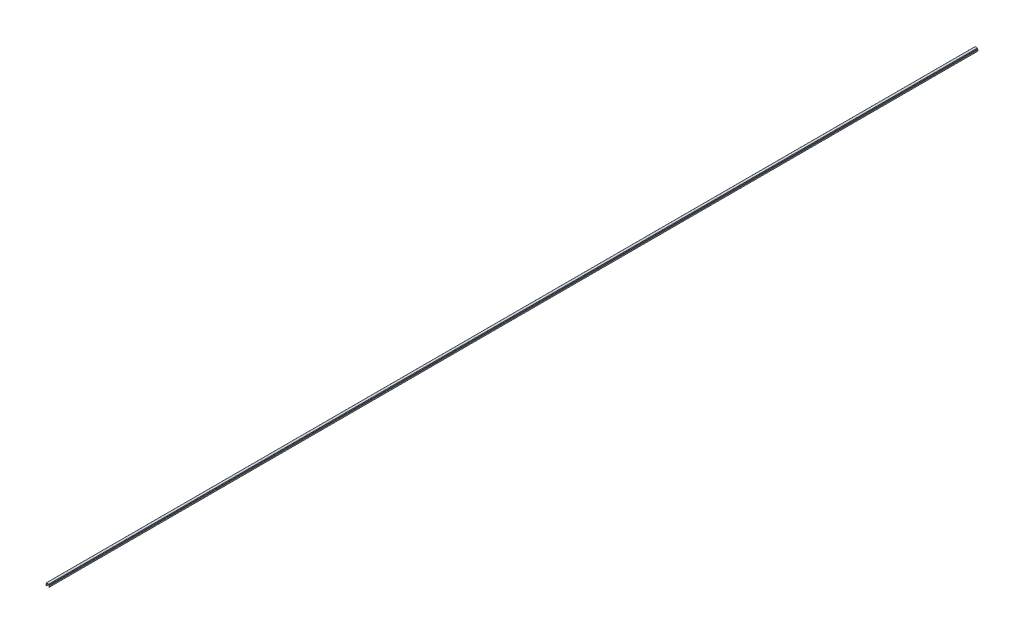
ISO-10303-21;
HEADER;
FILE_DESCRIPTION(('STEP AP214'),'2;1');
FILE_NAME('part.step','',(''),(''),'','','');
FILE_SCHEMA(('AUTOMOTIVE_DESIGN { 1 0 10303 214 1 1 1 1 }'));
ENDSEC;
DATA;
#1=APPLICATION_CONTEXT('core data for automotive mechanical design processes');
#2=APPLICATION_PROTOCOL_DEFINITION('international standard','automotive_design',2000,#1);
#3=PRODUCT_CONTEXT('',#1,'mechanical');
#4=PRODUCT('Part','Part','',(#3));
#5=PRODUCT_RELATED_PRODUCT_CATEGORY('part','',(#4));
#6=PRODUCT_DEFINITION_FORMATION('','',#4);
#7=PRODUCT_DEFINITION_CONTEXT('part definition',#1,'design');
#8=PRODUCT_DEFINITION('design','',#6,#7);
#9=PRODUCT_DEFINITION_SHAPE('','',#8);
#10=(LENGTH_UNIT() NAMED_UNIT(*) SI_UNIT(.MILLI.,.METRE.));
#11=(NAMED_UNIT(*) PLANE_ANGLE_UNIT() SI_UNIT($,.RADIAN.));
#12=(NAMED_UNIT(*) SI_UNIT($,.STERADIAN.) SOLID_ANGLE_UNIT());
#13=UNCERTAINTY_MEASURE_WITH_UNIT(LENGTH_MEASURE(1.E-05),#10,'distance_accuracy_value','');
#14=(GEOMETRIC_REPRESENTATION_CONTEXT(3) GLOBAL_UNCERTAINTY_ASSIGNED_CONTEXT((#13)) GLOBAL_UNIT_ASSIGNED_CONTEXT((#10,
#11,#12)) REPRESENTATION_CONTEXT('',''));
#15=CARTESIAN_POINT('',(0.,0.,0.));
#16=DIRECTION('',(0.,0.,1.));
#17=DIRECTION('',(1.,0.,0.));
#18=AXIS2_PLACEMENT_3D('',#15,#16,#17);
#19=CARTESIAN_POINT('',(-3.25000000000003,3.35000000000003,1000.));
#20=DIRECTION('',(0.,0.,-1.));
#21=DIRECTION('',(-1.,0.,0.));
#22=AXIS2_PLACEMENT_3D('',#19,#20,#21);
#23=CYLINDRICAL_SURFACE('',#22,0.349999999999972);
#24=DIRECTION('',(0.,0.,-1.));
#25=VECTOR('',#24,1.);
#26=CARTESIAN_POINT('',(-3.25,3.7,1000.));
#27=LINE('',#26,#25);
#28=CARTESIAN_POINT('',(-3.25,3.7,1000.));
#29=VERTEX_POINT('',#28);
#30=CARTESIAN_POINT('',(-3.25,3.7,-1000.));
#31=VERTEX_POINT('',#30);
#32=EDGE_CURVE('E211',#29,#31,#27,.T.);
#33=ORIENTED_EDGE('',*,*,#32,.T.);
#34=CARTESIAN_POINT('',(-3.25000000000003,3.35000000000003,-1000.));
#35=DIRECTION('',(0.,0.,1.));
#36=DIRECTION('',(1.,0.,0.));
#37=AXIS2_PLACEMENT_3D('',#34,#35,#36);
#38=CIRCLE('',#37,0.349999999999972);
#39=CARTESIAN_POINT('',(-3.6,3.35,-1000.));
#40=VERTEX_POINT('',#39);
#41=EDGE_CURVE('E205',#31,#40,#38,.T.);
#42=ORIENTED_EDGE('',*,*,#41,.T.);
#43=DIRECTION('',(0.,0.,-1.));
#44=VECTOR('',#43,1.);
#45=CARTESIAN_POINT('',(-3.6,3.35,1000.));
#46=LINE('',#45,#44);
#47=CARTESIAN_POINT('',(-3.6,3.35,1000.));
#48=VERTEX_POINT('',#47);
#49=EDGE_CURVE('E11',#48,#40,#46,.T.);
#50=ORIENTED_EDGE('',*,*,#49,.F.);
#51=CARTESIAN_POINT('',(-3.25000000000003,3.35000000000003,1000.));
#52=DIRECTION('',(0.,0.,1.));
#53=DIRECTION('',(1.,0.,0.));
#54=AXIS2_PLACEMENT_3D('',#51,#52,#53);
#55=CIRCLE('',#54,0.349999999999972);
#56=EDGE_CURVE('E277',#29,#48,#55,.T.);
#57=ORIENTED_EDGE('',*,*,#56,.F.);
#58=EDGE_LOOP('',(#33,#42,#50,#57));
#59=FACE_BOUND('',#58,.T.);
#60=ADVANCED_FACE('F33',(#59),#23,.T.);
#61=CARTESIAN_POINT('',(-3.6,3.35,1000.));
#62=DIRECTION('',(0.984336643247304,0.176299100283099,0.));
#63=DIRECTION('',(-0.176299100283099,0.984336643247304,0.));
#64=AXIS2_PLACEMENT_3D('',#61,#62,#63);
#65=PLANE('',#64);
#66=ORIENTED_EDGE('',*,*,#49,.T.);
#67=DIRECTION('',(0.176299100283099,-0.984336643247304,0.));
#68=VECTOR('',#67,1.);
#69=CARTESIAN_POINT('',(-3.6,3.35,-1000.));
#70=LINE('',#69,#68);
#71=CARTESIAN_POINT('',(-3.,0.,-1000.));
#72=VERTEX_POINT('',#71);
#73=EDGE_CURVE('E195',#40,#72,#70,.T.);
#74=ORIENTED_EDGE('',*,*,#73,.T.);
#75=DIRECTION('',(0.,0.,-1.));
#76=VECTOR('',#75,1.);
#77=CARTESIAN_POINT('',(-3.,0.,1000.));
#78=LINE('',#77,#76);
#79=CARTESIAN_POINT('',(-3.,0.,1000.));
#80=VERTEX_POINT('',#79);
#81=EDGE_CURVE('E40',#80,#72,#78,.T.);
#82=ORIENTED_EDGE('',*,*,#81,.F.);
#83=DIRECTION('',(0.176299100283099,-0.984336643247304,0.));
#84=VECTOR('',#83,1.);
#85=CARTESIAN_POINT('',(-3.6,3.35,1000.));
#86=LINE('',#85,#84);
#87=EDGE_CURVE('E196',#48,#80,#86,.T.);
#88=ORIENTED_EDGE('',*,*,#87,.F.);
#89=EDGE_LOOP('',(#66,#74,#82,#88));
#90=FACE_BOUND('',#89,.T.);
#91=ADVANCED_FACE('F193',(#90),#65,.F.);
#92=CARTESIAN_POINT('',(-3.,0.,1000.));
#93=DIRECTION('',(0.,1.,0.));
#94=DIRECTION('',(0.,0.,1.));
#95=AXIS2_PLACEMENT_3D('',#92,#93,#94);
#96=PLANE('',#95);
#97=ORIENTED_EDGE('',*,*,#81,.T.);
#98=DIRECTION('',(1.,0.,0.));
#99=VECTOR('',#98,1.);
#100=CARTESIAN_POINT('',(-3.,0.,-1000.));
#101=LINE('',#100,#99);
#102=CARTESIAN_POINT('',(-2.2,0.,-1000.));
#103=VERTEX_POINT('',#102);
#104=EDGE_CURVE('E209',#72,#103,#101,.T.);
#105=ORIENTED_EDGE('',*,*,#104,.T.);
#106=DIRECTION('',(0.,0.,-1.));
#107=VECTOR('',#106,1.);
#108=CARTESIAN_POINT('',(-2.2,0.,1000.));
#109=LINE('',#108,#107);
#110=CARTESIAN_POINT('',(-2.2,0.,1000.));
#111=VERTEX_POINT('',#110);
#112=EDGE_CURVE('E363',#111,#103,#109,.T.);
#113=ORIENTED_EDGE('',*,*,#112,.F.);
#114=DIRECTION('',(1.,0.,0.));
#115=VECTOR('',#114,1.);
#116=CARTESIAN_POINT('',(-3.,0.,1000.));
#117=LINE('',#116,#115);
#118=EDGE_CURVE('E280',#80,#111,#117,.T.);
#119=ORIENTED_EDGE('',*,*,#118,.F.);
#120=EDGE_LOOP('',(#97,#105,#113,#119));
#121=FACE_BOUND('',#120,.T.);
#122=ADVANCED_FACE('F366',(#121),#96,.F.);
#123=CARTESIAN_POINT('',(-2.2,0.,1000.));
#124=DIRECTION('',(-0.984336643247306,-0.176299100283088,0.));
#125=DIRECTION('',(0.176299100283088,-0.984336643247306,0.));
#126=AXIS2_PLACEMENT_3D('',#123,#124,#125);
#127=PLANE('',#126);
#128=ORIENTED_EDGE('',*,*,#112,.T.);
#129=DIRECTION('',(-0.176299100283088,0.984336643247306,0.));
#130=VECTOR('',#129,1.);
#131=CARTESIAN_POINT('',(-2.2,0.,-1000.));
#132=LINE('',#131,#130);
#133=CARTESIAN_POINT('',(-2.7352170713255,2.9882953149009,-1000.));
#134=VERTEX_POINT('',#133);
#135=EDGE_CURVE('E215',#103,#134,#132,.T.);
#136=ORIENTED_EDGE('',*,*,#135,.T.);
#137=DIRECTION('',(0.,0.,-1.));
#138=VECTOR('',#137,1.);
#139=CARTESIAN_POINT('',(-2.7352170713255,2.9882953149009,1000.));
#140=LINE('',#139,#138);
#141=CARTESIAN_POINT('',(-2.7352170713255,2.9882953149009,1000.));
#142=VERTEX_POINT('',#141);
#143=EDGE_CURVE('E361',#142,#134,#140,.T.);
#144=ORIENTED_EDGE('',*,*,#143,.F.);
#145=DIRECTION('',(-0.176299100283088,0.984336643247306,0.));
#146=VECTOR('',#145,1.);
#147=CARTESIAN_POINT('',(-2.2,0.,1000.));
#148=LINE('',#147,#146);
#149=EDGE_CURVE('E282',#111,#142,#148,.T.);
#150=ORIENTED_EDGE('',*,*,#149,.F.);
#151=EDGE_LOOP('',(#128,#136,#144,#150));
#152=FACE_BOUND('',#151,.T.);
#153=ADVANCED_FACE('F374',(#152),#127,.F.);
#154=CARTESIAN_POINT('',(-2.390699246189,3.05000000000004,1000.));
#155=DIRECTION('',(0.,0.,-1.));
#156=DIRECTION('',(-1.,0.,0.));
#157=AXIS2_PLACEMENT_3D('',#154,#155,#156);
#158=CYLINDRICAL_SURFACE('',#157,0.349999999999955);
#159=ORIENTED_EDGE('',*,*,#143,.T.);
#160=CARTESIAN_POINT('',(-2.390699246189,3.05000000000004,-1000.));
#161=DIRECTION('',(0.,0.,-1.));
#162=DIRECTION('',(-1.,0.,0.));
#163=AXIS2_PLACEMENT_3D('',#160,#161,#162);
#164=CIRCLE('',#163,0.349999999999955);
#165=CARTESIAN_POINT('',(-2.390699246189,3.4,-1000.));
#166=VERTEX_POINT('',#165);
#167=EDGE_CURVE('E218',#134,#166,#164,.T.);
#168=ORIENTED_EDGE('',*,*,#167,.T.);
#169=DIRECTION('',(0.,0.,-1.));
#170=VECTOR('',#169,1.);
#171=CARTESIAN_POINT('',(-2.390699246189,3.4,1000.));
#172=LINE('',#171,#170);
#173=CARTESIAN_POINT('',(-2.390699246189,3.4,1000.));
#174=VERTEX_POINT('',#173);
#175=EDGE_CURVE('E359',#174,#166,#172,.T.);
#176=ORIENTED_EDGE('',*,*,#175,.F.);
#177=CARTESIAN_POINT('',(-2.390699246189,3.05000000000004,1000.));
#178=DIRECTION('',(0.,0.,-1.));
#179=DIRECTION('',(-1.,0.,0.));
#180=AXIS2_PLACEMENT_3D('',#177,#178,#179);
#181=CIRCLE('',#180,0.349999999999955);
#182=EDGE_CURVE('E284',#142,#174,#181,.T.);
#183=ORIENTED_EDGE('',*,*,#182,.F.);
#184=EDGE_LOOP('',(#159,#168,#176,#183));
#185=FACE_BOUND('',#184,.T.);
#186=ADVANCED_FACE('F377',(#185),#158,.F.);
#187=CARTESIAN_POINT('',(-2.390699246189,3.4,1000.));
#188=DIRECTION('',(0.,1.,0.));
#189=DIRECTION('',(0.,0.,1.));
#190=AXIS2_PLACEMENT_3D('',#187,#188,#189);
#191=PLANE('',#190);
#192=ORIENTED_EDGE('',*,*,#175,.T.);
#193=DIRECTION('',(1.,0.,0.));
#194=VECTOR('',#193,1.);
#195=CARTESIAN_POINT('',(-2.390699246189,3.4,-1000.));
#196=LINE('',#195,#194);
#197=CARTESIAN_POINT('',(-2.2,3.4,-1000.));
#198=VERTEX_POINT('',#197);
#199=EDGE_CURVE('E221',#166,#198,#196,.T.);
#200=ORIENTED_EDGE('',*,*,#199,.T.);
#201=DIRECTION('',(0.,0.,-1.));
#202=VECTOR('',#201,1.);
#203=CARTESIAN_POINT('',(-2.2,3.4,1000.));
#204=LINE('',#203,#202);
#205=CARTESIAN_POINT('',(-2.2,3.4,1000.));
#206=VERTEX_POINT('',#205);
#207=EDGE_CURVE('E357',#206,#198,#204,.T.);
#208=ORIENTED_EDGE('',*,*,#207,.F.);
#209=DIRECTION('',(1.,0.,0.));
#210=VECTOR('',#209,1.);
#211=CARTESIAN_POINT('',(-2.390699246189,3.4,1000.));
#212=LINE('',#211,#210);
#213=EDGE_CURVE('E286',#174,#206,#212,.T.);
#214=ORIENTED_EDGE('',*,*,#213,.F.);
#215=EDGE_LOOP('',(#192,#200,#208,#214));
#216=FACE_BOUND('',#215,.T.);
#217=ADVANCED_FACE('F382',(#216),#191,.F.);
#218=CARTESIAN_POINT('',(-2.2,3.4,1000.));
#219=DIRECTION('',(-0.996194698091743,0.08715574274769,0.));
#220=DIRECTION('',(-0.08715574274769,-0.996194698091743,0.));
#221=AXIS2_PLACEMENT_3D('',#218,#219,#220);
#222=PLANE('',#221);
#223=ORIENTED_EDGE('',*,*,#207,.T.);
#224=DIRECTION('',(0.08715574274769,0.996194698091743,0.));
#225=VECTOR('',#224,1.);
#226=CARTESIAN_POINT('',(-2.2,3.4,-1000.));
#227=LINE('',#226,#225);
#228=CARTESIAN_POINT('',(-2.0704726390793,4.8805045099617,-1000.));
#229=VERTEX_POINT('',#228);
#230=EDGE_CURVE('E224',#198,#229,#227,.T.);
#231=ORIENTED_EDGE('',*,*,#230,.T.);
#232=DIRECTION('',(0.,0.,-1.));
#233=VECTOR('',#232,1.);
#234=CARTESIAN_POINT('',(-2.0704726390793,4.8805045099617,1000.));
#235=LINE('',#234,#233);
#236=CARTESIAN_POINT('',(-2.0704726390793,4.8805045099617,1000.));
#237=VERTEX_POINT('',#236);
#238=EDGE_CURVE('E355',#237,#229,#235,.T.);
#239=ORIENTED_EDGE('',*,*,#238,.F.);
#240=DIRECTION('',(0.08715574274769,0.996194698091743,0.));
#241=VECTOR('',#240,1.);
#242=CARTESIAN_POINT('',(-2.2,3.4,1000.));
#243=LINE('',#242,#241);
#244=EDGE_CURVE('E288',#206,#237,#243,.T.);
#245=ORIENTED_EDGE('',*,*,#244,.F.);
#246=EDGE_LOOP('',(#223,#231,#239,#245));
#247=FACE_BOUND('',#246,.T.);
#248=ADVANCED_FACE('F388',(#247),#222,.F.);
#249=CARTESIAN_POINT('',(-1.72180449474716,4.84999999999996,1000.));
#250=DIRECTION('',(0.,0.,-1.));
#251=DIRECTION('',(-1.,0.,0.));
#252=AXIS2_PLACEMENT_3D('',#249,#250,#251);
#253=CYLINDRICAL_SURFACE('',#252,0.350000000000036);
#254=ORIENTED_EDGE('',*,*,#238,.T.);
#255=CARTESIAN_POINT('',(-1.72180449474716,4.84999999999996,-1000.));
#256=DIRECTION('',(0.,0.,-1.));
#257=DIRECTION('',(-1.,0.,0.));
#258=AXIS2_PLACEMENT_3D('',#255,#256,#257);
#259=CIRCLE('',#258,0.350000000000036);
#260=CARTESIAN_POINT('',(-1.7218044947472,5.2,-1000.));
#261=VERTEX_POINT('',#260);
#262=EDGE_CURVE('E227',#229,#261,#259,.T.);
#263=ORIENTED_EDGE('',*,*,#262,.T.);
#264=DIRECTION('',(0.,0.,-1.));
#265=VECTOR('',#264,1.);
#266=CARTESIAN_POINT('',(-1.7218044947472,5.2,1000.));
#267=LINE('',#266,#265);
#268=CARTESIAN_POINT('',(-1.7218044947472,5.2,1000.));
#269=VERTEX_POINT('',#268);
#270=EDGE_CURVE('E353',#269,#261,#267,.T.);
#271=ORIENTED_EDGE('',*,*,#270,.F.);
#272=CARTESIAN_POINT('',(-1.72180449474716,4.84999999999996,1000.));
#273=DIRECTION('',(0.,0.,-1.));
#274=DIRECTION('',(-1.,0.,0.));
#275=AXIS2_PLACEMENT_3D('',#272,#273,#274);
#276=CIRCLE('',#275,0.350000000000036);
#277=EDGE_CURVE('E290',#237,#269,#276,.T.);
#278=ORIENTED_EDGE('',*,*,#277,.F.);
#279=EDGE_LOOP('',(#254,#263,#271,#278));
#280=FACE_BOUND('',#279,.T.);
#281=ADVANCED_FACE('F392',(#280),#253,.F.);
#282=CARTESIAN_POINT('',(-1.7218044947472,5.2,1000.));
#283=DIRECTION('',(0.,1.,0.));
#284=DIRECTION('',(0.,0.,1.));
#285=AXIS2_PLACEMENT_3D('',#282,#283,#284);
#286=PLANE('',#285);
#287=ORIENTED_EDGE('',*,*,#270,.T.);
#288=DIRECTION('',(1.,0.,0.));
#289=VECTOR('',#288,1.);
#290=CARTESIAN_POINT('',(-1.7218044947472,5.2,-1000.));
#291=LINE('',#290,#289);
#292=CARTESIAN_POINT('',(1.7218044947472,5.2,-1000.));
#293=VERTEX_POINT('',#292);
#294=EDGE_CURVE('E230',#261,#293,#291,.T.);
#295=ORIENTED_EDGE('',*,*,#294,.T.);
#296=DIRECTION('',(0.,0.,-1.));
#297=VECTOR('',#296,1.);
#298=CARTESIAN_POINT('',(1.7218044947472,5.2,1000.));
#299=LINE('',#298,#297);
#300=CARTESIAN_POINT('',(1.7218044947472,5.2,1000.));
#301=VERTEX_POINT('',#300);
#302=EDGE_CURVE('E351',#301,#293,#299,.T.);
#303=ORIENTED_EDGE('',*,*,#302,.F.);
#304=DIRECTION('',(1.,0.,0.));
#305=VECTOR('',#304,1.);
#306=CARTESIAN_POINT('',(-1.7218044947472,5.2,1000.));
#307=LINE('',#306,#305);
#308=EDGE_CURVE('E292',#269,#301,#307,.T.);
#309=ORIENTED_EDGE('',*,*,#308,.F.);
#310=EDGE_LOOP('',(#287,#295,#303,#309));
#311=FACE_BOUND('',#310,.T.);
#312=ADVANCED_FACE('F397',(#311),#286,.F.);
#313=CARTESIAN_POINT('',(1.72180449474716,4.84999999999996,1000.));
#314=DIRECTION('',(0.,0.,-1.));
#315=DIRECTION('',(-1.,0.,0.));
#316=AXIS2_PLACEMENT_3D('',#313,#314,#315);
#317=CYLINDRICAL_SURFACE('',#316,0.350000000000036);
#318=ORIENTED_EDGE('',*,*,#302,.T.);
#319=CARTESIAN_POINT('',(1.72180449474716,4.84999999999996,-1000.));
#320=DIRECTION('',(0.,0.,-1.));
#321=DIRECTION('',(-1.,0.,0.));
#322=AXIS2_PLACEMENT_3D('',#319,#320,#321);
#323=CIRCLE('',#322,0.350000000000036);
#324=CARTESIAN_POINT('',(2.0704726390793,4.8805045099617,-1000.));
#325=VERTEX_POINT('',#324);
#326=EDGE_CURVE('E233',#293,#325,#323,.T.);
#327=ORIENTED_EDGE('',*,*,#326,.T.);
#328=DIRECTION('',(0.,0.,-1.));
#329=VECTOR('',#328,1.);
#330=CARTESIAN_POINT('',(2.0704726390793,4.8805045099617,1000.));
#331=LINE('',#330,#329);
#332=CARTESIAN_POINT('',(2.0704726390793,4.8805045099617,1000.));
#333=VERTEX_POINT('',#332);
#334=EDGE_CURVE('E349',#333,#325,#331,.T.);
#335=ORIENTED_EDGE('',*,*,#334,.F.);
#336=CARTESIAN_POINT('',(1.72180449474716,4.84999999999996,1000.));
#337=DIRECTION('',(0.,0.,-1.));
#338=DIRECTION('',(-1.,0.,0.));
#339=AXIS2_PLACEMENT_3D('',#336,#337,#338);
#340=CIRCLE('',#339,0.350000000000036);
#341=EDGE_CURVE('E294',#301,#333,#340,.T.);
#342=ORIENTED_EDGE('',*,*,#341,.F.);
#343=EDGE_LOOP('',(#318,#327,#335,#342));
#344=FACE_BOUND('',#343,.T.);
#345=ADVANCED_FACE('F403',(#344),#317,.F.);
#346=CARTESIAN_POINT('',(2.0704726390793,4.8805045099617,1000.));
#347=DIRECTION('',(0.996194698091743,0.08715574274769,0.));
#348=DIRECTION('',(-0.08715574274769,0.996194698091743,0.));
#349=AXIS2_PLACEMENT_3D('',#346,#347,#348);
#350=PLANE('',#349);
#351=ORIENTED_EDGE('',*,*,#334,.T.);
#352=DIRECTION('',(0.08715574274769,-0.996194698091743,0.));
#353=VECTOR('',#352,1.);
#354=CARTESIAN_POINT('',(2.0704726390793,4.8805045099617,-1000.));
#355=LINE('',#354,#353);
#356=CARTESIAN_POINT('',(2.2,3.4,-1000.));
#357=VERTEX_POINT('',#356);
#358=EDGE_CURVE('E236',#325,#357,#355,.T.);
#359=ORIENTED_EDGE('',*,*,#358,.T.);
#360=DIRECTION('',(0.,0.,-1.));
#361=VECTOR('',#360,1.);
#362=CARTESIAN_POINT('',(2.2,3.4,1000.));
#363=LINE('',#362,#361);
#364=CARTESIAN_POINT('',(2.2,3.4,1000.));
#365=VERTEX_POINT('',#364);
#366=EDGE_CURVE('E347',#365,#357,#363,.T.);
#367=ORIENTED_EDGE('',*,*,#366,.F.);
#368=DIRECTION('',(0.08715574274769,-0.996194698091743,0.));
#369=VECTOR('',#368,1.);
#370=CARTESIAN_POINT('',(2.0704726390793,4.8805045099617,1000.));
#371=LINE('',#370,#369);
#372=EDGE_CURVE('E296',#333,#365,#371,.T.);
#373=ORIENTED_EDGE('',*,*,#372,.F.);
#374=EDGE_LOOP('',(#351,#359,#367,#373));
#375=FACE_BOUND('',#374,.T.);
#376=ADVANCED_FACE('F407',(#375),#350,.F.);
#377=CARTESIAN_POINT('',(2.2,3.4,1000.));
#378=DIRECTION('',(0.,1.,0.));
#379=DIRECTION('',(0.,0.,1.));
#380=AXIS2_PLACEMENT_3D('',#377,#378,#379);
#381=PLANE('',#380);
#382=ORIENTED_EDGE('',*,*,#366,.T.);
#383=DIRECTION('',(1.,0.,0.));
#384=VECTOR('',#383,1.);
#385=CARTESIAN_POINT('',(2.2,3.4,-1000.));
#386=LINE('',#385,#384);
#387=CARTESIAN_POINT('',(2.390699246189,3.4,-1000.));
#388=VERTEX_POINT('',#387);
#389=EDGE_CURVE('E239',#357,#388,#386,.T.);
#390=ORIENTED_EDGE('',*,*,#389,.T.);
#391=DIRECTION('',(0.,0.,-1.));
#392=VECTOR('',#391,1.);
#393=CARTESIAN_POINT('',(2.390699246189,3.4,1000.));
#394=LINE('',#393,#392);
#395=CARTESIAN_POINT('',(2.390699246189,3.4,1000.));
#396=VERTEX_POINT('',#395);
#397=EDGE_CURVE('E345',#396,#388,#394,.T.);
#398=ORIENTED_EDGE('',*,*,#397,.F.);
#399=DIRECTION('',(1.,0.,0.));
#400=VECTOR('',#399,1.);
#401=CARTESIAN_POINT('',(2.2,3.4,1000.));
#402=LINE('',#401,#400);
#403=EDGE_CURVE('E298',#365,#396,#402,.T.);
#404=ORIENTED_EDGE('',*,*,#403,.F.);
#405=EDGE_LOOP('',(#382,#390,#398,#404));
#406=FACE_BOUND('',#405,.T.);
#407=ADVANCED_FACE('F412',(#406),#381,.F.);
#408=CARTESIAN_POINT('',(2.390699246189,3.05000000000004,1000.));
#409=DIRECTION('',(0.,0.,-1.));
#410=DIRECTION('',(-1.,0.,0.));
#411=AXIS2_PLACEMENT_3D('',#408,#409,#410);
#412=CYLINDRICAL_SURFACE('',#411,0.349999999999955);
#413=ORIENTED_EDGE('',*,*,#397,.T.);
#414=CARTESIAN_POINT('',(2.390699246189,3.05000000000004,-1000.));
#415=DIRECTION('',(0.,0.,-1.));
#416=DIRECTION('',(-1.,0.,0.));
#417=AXIS2_PLACEMENT_3D('',#414,#415,#416);
#418=CIRCLE('',#417,0.349999999999955);
#419=CARTESIAN_POINT('',(2.7352170713255,2.9882953149009,-1000.));
#420=VERTEX_POINT('',#419);
#421=EDGE_CURVE('E242',#388,#420,#418,.T.);
#422=ORIENTED_EDGE('',*,*,#421,.T.);
#423=DIRECTION('',(0.,0.,-1.));
#424=VECTOR('',#423,1.);
#425=CARTESIAN_POINT('',(2.7352170713255,2.9882953149009,1000.));
#426=LINE('',#425,#424);
#427=CARTESIAN_POINT('',(2.7352170713255,2.9882953149009,1000.));
#428=VERTEX_POINT('',#427);
#429=EDGE_CURVE('E343',#428,#420,#426,.T.);
#430=ORIENTED_EDGE('',*,*,#429,.F.);
#431=CARTESIAN_POINT('',(2.390699246189,3.05000000000004,1000.));
#432=DIRECTION('',(0.,0.,-1.));
#433=DIRECTION('',(-1.,0.,0.));
#434=AXIS2_PLACEMENT_3D('',#431,#432,#433);
#435=CIRCLE('',#434,0.349999999999955);
#436=EDGE_CURVE('E300',#396,#428,#435,.T.);
#437=ORIENTED_EDGE('',*,*,#436,.F.);
#438=EDGE_LOOP('',(#413,#422,#430,#437));
#439=FACE_BOUND('',#438,.T.);
#440=ADVANCED_FACE('F418',(#439),#412,.F.);
#441=CARTESIAN_POINT('',(2.7352170713255,2.9882953149009,1000.));
#442=DIRECTION('',(0.984336643247306,-0.176299100283088,0.));
#443=DIRECTION('',(0.176299100283088,0.984336643247306,0.));
#444=AXIS2_PLACEMENT_3D('',#441,#442,#443);
#445=PLANE('',#444);
#446=ORIENTED_EDGE('',*,*,#429,.T.);
#447=DIRECTION('',(-0.176299100283088,-0.984336643247306,0.));
#448=VECTOR('',#447,1.);
#449=CARTESIAN_POINT('',(2.7352170713255,2.9882953149009,-1000.));
#450=LINE('',#449,#448);
#451=CARTESIAN_POINT('',(2.2,0.,-1000.));
#452=VERTEX_POINT('',#451);
#453=EDGE_CURVE('E245',#420,#452,#450,.T.);
#454=ORIENTED_EDGE('',*,*,#453,.T.);
#455=DIRECTION('',(0.,0.,-1.));
#456=VECTOR('',#455,1.);
#457=CARTESIAN_POINT('',(2.2,0.,1000.));
#458=LINE('',#457,#456);
#459=CARTESIAN_POINT('',(2.2,0.,1000.));
#460=VERTEX_POINT('',#459);
#461=EDGE_CURVE('E341',#460,#452,#458,.T.);
#462=ORIENTED_EDGE('',*,*,#461,.F.);
#463=DIRECTION('',(-0.176299100283088,-0.984336643247306,0.));
#464=VECTOR('',#463,1.);
#465=CARTESIAN_POINT('',(2.7352170713255,2.9882953149009,1000.));
#466=LINE('',#465,#464);
#467=EDGE_CURVE('E302',#428,#460,#466,.T.);
#468=ORIENTED_EDGE('',*,*,#467,.F.);
#469=EDGE_LOOP('',(#446,#454,#462,#468));
#470=FACE_BOUND('',#469,.T.);
#471=ADVANCED_FACE('F422',(#470),#445,.F.);
#472=CARTESIAN_POINT('',(2.2,0.,1000.));
#473=DIRECTION('',(0.,1.,0.));
#474=DIRECTION('',(0.,0.,1.));
#475=AXIS2_PLACEMENT_3D('',#472,#473,#474);
#476=PLANE('',#475);
#477=ORIENTED_EDGE('',*,*,#461,.T.);
#478=DIRECTION('',(1.,0.,0.));
#479=VECTOR('',#478,1.);
#480=CARTESIAN_POINT('',(2.2,0.,-1000.));
#481=LINE('',#480,#479);
#482=CARTESIAN_POINT('',(3.,0.,-1000.));
#483=VERTEX_POINT('',#482);
#484=EDGE_CURVE('E248',#452,#483,#481,.T.);
#485=ORIENTED_EDGE('',*,*,#484,.T.);
#486=DIRECTION('',(0.,0.,-1.));
#487=VECTOR('',#486,1.);
#488=CARTESIAN_POINT('',(3.,0.,1000.));
#489=LINE('',#488,#487);
#490=CARTESIAN_POINT('',(3.,0.,1000.));
#491=VERTEX_POINT('',#490);
#492=EDGE_CURVE('E339',#491,#483,#489,.T.);
#493=ORIENTED_EDGE('',*,*,#492,.F.);
#494=DIRECTION('',(1.,0.,0.));
#495=VECTOR('',#494,1.);
#496=CARTESIAN_POINT('',(2.2,0.,1000.));
#497=LINE('',#496,#495);
#498=EDGE_CURVE('E304',#460,#491,#497,.T.);
#499=ORIENTED_EDGE('',*,*,#498,.F.);
#500=EDGE_LOOP('',(#477,#485,#493,#499));
#501=FACE_BOUND('',#500,.T.);
#502=ADVANCED_FACE('F427',(#501),#476,.F.);
#503=CARTESIAN_POINT('',(3.,0.,1000.));
#504=DIRECTION('',(-0.984336643247304,0.176299100283099,0.));
#505=DIRECTION('',(-0.176299100283099,-0.984336643247304,0.));
#506=AXIS2_PLACEMENT_3D('',#503,#504,#505);
#507=PLANE('',#506);
#508=ORIENTED_EDGE('',*,*,#492,.T.);
#509=DIRECTION('',(0.176299100283099,0.984336643247304,0.));
#510=VECTOR('',#509,1.);
#511=CARTESIAN_POINT('',(3.,0.,-1000.));
#512=LINE('',#511,#510);
#513=CARTESIAN_POINT('',(3.6,3.35,-1000.));
#514=VERTEX_POINT('',#513);
#515=EDGE_CURVE('E251',#483,#514,#512,.T.);
#516=ORIENTED_EDGE('',*,*,#515,.T.);
#517=DIRECTION('',(0.,0.,-1.));
#518=VECTOR('',#517,1.);
#519=CARTESIAN_POINT('',(3.6,3.35,1000.));
#520=LINE('',#519,#518);
#521=CARTESIAN_POINT('',(3.6,3.35,1000.));
#522=VERTEX_POINT('',#521);
#523=EDGE_CURVE('E337',#522,#514,#520,.T.);
#524=ORIENTED_EDGE('',*,*,#523,.F.);
#525=DIRECTION('',(0.176299100283099,0.984336643247304,0.));
#526=VECTOR('',#525,1.);
#527=CARTESIAN_POINT('',(3.,0.,1000.));
#528=LINE('',#527,#526);
#529=EDGE_CURVE('E306',#491,#522,#528,.T.);
#530=ORIENTED_EDGE('',*,*,#529,.F.);
#531=EDGE_LOOP('',(#508,#516,#524,#530));
#532=FACE_BOUND('',#531,.T.);
#533=ADVANCED_FACE('F433',(#532),#507,.F.);
#534=CARTESIAN_POINT('',(3.25000000000003,3.35000000000003,1000.));
#535=DIRECTION('',(0.,0.,-1.));
#536=DIRECTION('',(-1.,0.,0.));
#537=AXIS2_PLACEMENT_3D('',#534,#535,#536);
#538=CYLINDRICAL_SURFACE('',#537,0.349999999999972);
#539=ORIENTED_EDGE('',*,*,#523,.T.);
#540=CARTESIAN_POINT('',(3.25000000000003,3.35000000000003,-1000.));
#541=DIRECTION('',(0.,0.,1.));
#542=DIRECTION('',(1.,0.,0.));
#543=AXIS2_PLACEMENT_3D('',#540,#541,#542);
#544=CIRCLE('',#543,0.349999999999972);
#545=CARTESIAN_POINT('',(3.25,3.7,-1000.));
#546=VERTEX_POINT('',#545);
#547=EDGE_CURVE('E254',#514,#546,#544,.T.);
#548=ORIENTED_EDGE('',*,*,#547,.T.);
#549=DIRECTION('',(0.,0.,-1.));
#550=VECTOR('',#549,1.);
#551=CARTESIAN_POINT('',(3.25,3.7,1000.));
#552=LINE('',#551,#550);
#553=CARTESIAN_POINT('',(3.25,3.7,1000.));
#554=VERTEX_POINT('',#553);
#555=EDGE_CURVE('E335',#554,#546,#552,.T.);
#556=ORIENTED_EDGE('',*,*,#555,.F.);
#557=CARTESIAN_POINT('',(3.25000000000003,3.35000000000003,1000.));
#558=DIRECTION('',(0.,0.,1.));
#559=DIRECTION('',(1.,0.,0.));
#560=AXIS2_PLACEMENT_3D('',#557,#558,#559);
#561=CIRCLE('',#560,0.349999999999972);
#562=EDGE_CURVE('E308',#522,#554,#561,.T.);
#563=ORIENTED_EDGE('',*,*,#562,.F.);
#564=EDGE_LOOP('',(#539,#548,#556,#563));
#565=FACE_BOUND('',#564,.T.);
#566=ADVANCED_FACE('F437',(#565),#538,.T.);
#567=CARTESIAN_POINT('',(3.25,3.7,1000.));
#568=DIRECTION('',(0.,-1.,0.));
#569=DIRECTION('',(0.,0.,-1.));
#570=AXIS2_PLACEMENT_3D('',#567,#568,#569);
#571=PLANE('',#570);
#572=ORIENTED_EDGE('',*,*,#555,.T.);
#573=DIRECTION('',(-1.,0.,0.));
#574=VECTOR('',#573,1.);
#575=CARTESIAN_POINT('',(3.25,3.7,-1000.));
#576=LINE('',#575,#574);
#577=CARTESIAN_POINT('',(3.,3.7,-1000.));
#578=VERTEX_POINT('',#577);
#579=EDGE_CURVE('E257',#546,#578,#576,.T.);
#580=ORIENTED_EDGE('',*,*,#579,.T.);
#581=DIRECTION('',(0.,0.,-1.));
#582=VECTOR('',#581,1.);
#583=CARTESIAN_POINT('',(3.,3.7,1000.));
#584=LINE('',#583,#582);
#585=CARTESIAN_POINT('',(3.,3.7,1000.));
#586=VERTEX_POINT('',#585);
#587=EDGE_CURVE('E333',#586,#578,#584,.T.);
#588=ORIENTED_EDGE('',*,*,#587,.F.);
#589=DIRECTION('',(-1.,0.,0.));
#590=VECTOR('',#589,1.);
#591=CARTESIAN_POINT('',(3.25,3.7,1000.));
#592=LINE('',#591,#590);
#593=EDGE_CURVE('E310',#554,#586,#592,.T.);
#594=ORIENTED_EDGE('',*,*,#593,.F.);
#595=EDGE_LOOP('',(#572,#580,#588,#594));
#596=FACE_BOUND('',#595,.T.);
#597=ADVANCED_FACE('F442',(#596),#571,.F.);
#598=CARTESIAN_POINT('',(3.,3.7,1000.));
#599=DIRECTION('',(-0.996194698091747,-0.0871557427476467,0.));
#600=DIRECTION('',(0.0871557427476467,-0.996194698091747,0.));
#601=AXIS2_PLACEMENT_3D('',#598,#599,#600);
#602=PLANE('',#601);
#603=ORIENTED_EDGE('',*,*,#587,.T.);
#604=DIRECTION('',(-0.0871557427476467,0.996194698091747,0.));
#605=VECTOR('',#604,1.);
#606=CARTESIAN_POINT('',(3.,3.7,-1000.));
#607=LINE('',#606,#605);
#608=CARTESIAN_POINT('',(2.835477173669,5.5805045099617,-1000.));
#609=VERTEX_POINT('',#608);
#610=EDGE_CURVE('E260',#578,#609,#607,.T.);
#611=ORIENTED_EDGE('',*,*,#610,.T.);
#612=DIRECTION('',(0.,0.,-1.));
#613=VECTOR('',#612,1.);
#614=CARTESIAN_POINT('',(2.835477173669,5.5805045099617,1000.));
#615=LINE('',#614,#613);
#616=CARTESIAN_POINT('',(2.835477173669,5.5805045099617,1000.));
#617=VERTEX_POINT('',#616);
#618=EDGE_CURVE('E331',#617,#609,#615,.T.);
#619=ORIENTED_EDGE('',*,*,#618,.F.);
#620=DIRECTION('',(-0.0871557427476467,0.996194698091747,0.));
#621=VECTOR('',#620,1.);
#622=CARTESIAN_POINT('',(3.,3.7,1000.));
#623=LINE('',#622,#621);
#624=EDGE_CURVE('E312',#586,#617,#623,.T.);
#625=ORIENTED_EDGE('',*,*,#624,.F.);
#626=EDGE_LOOP('',(#603,#611,#619,#625));
#627=FACE_BOUND('',#626,.T.);
#628=ADVANCED_FACE('F448',(#627),#602,.F.);
#629=CARTESIAN_POINT('',(2.48680902933686,5.54999999999996,1000.));
#630=DIRECTION('',(0.,0.,-1.));
#631=DIRECTION('',(-1.,0.,0.));
#632=AXIS2_PLACEMENT_3D('',#629,#630,#631);
#633=CYLINDRICAL_SURFACE('',#632,0.350000000000036);
#634=ORIENTED_EDGE('',*,*,#618,.T.);
#635=CARTESIAN_POINT('',(2.48680902933686,5.54999999999996,-1000.));
#636=DIRECTION('',(0.,0.,1.));
#637=DIRECTION('',(1.,0.,0.));
#638=AXIS2_PLACEMENT_3D('',#635,#636,#637);
#639=CIRCLE('',#638,0.350000000000036);
#640=CARTESIAN_POINT('',(2.4868090293369,5.9,-1000.));
#641=VERTEX_POINT('',#640);
#642=EDGE_CURVE('E263',#609,#641,#639,.T.);
#643=ORIENTED_EDGE('',*,*,#642,.T.);
#644=DIRECTION('',(0.,0.,-1.));
#645=VECTOR('',#644,1.);
#646=CARTESIAN_POINT('',(2.4868090293369,5.9,1000.));
#647=LINE('',#646,#645);
#648=CARTESIAN_POINT('',(2.4868090293369,5.9,1000.));
#649=VERTEX_POINT('',#648);
#650=EDGE_CURVE('E329',#649,#641,#647,.T.);
#651=ORIENTED_EDGE('',*,*,#650,.F.);
#652=CARTESIAN_POINT('',(2.48680902933686,5.54999999999996,1000.));
#653=DIRECTION('',(0.,0.,1.));
#654=DIRECTION('',(1.,0.,0.));
#655=AXIS2_PLACEMENT_3D('',#652,#653,#654);
#656=CIRCLE('',#655,0.350000000000036);
#657=EDGE_CURVE('E314',#617,#649,#656,.T.);
#658=ORIENTED_EDGE('',*,*,#657,.F.);
#659=EDGE_LOOP('',(#634,#643,#651,#658));
#660=FACE_BOUND('',#659,.T.);
#661=ADVANCED_FACE('F452',(#660),#633,.T.);
#662=CARTESIAN_POINT('',(2.4868090293369,5.9,1000.));
#663=DIRECTION('',(0.,-1.,0.));
#664=DIRECTION('',(0.,0.,-1.));
#665=AXIS2_PLACEMENT_3D('',#662,#663,#664);
#666=PLANE('',#665);
#667=ORIENTED_EDGE('',*,*,#650,.T.);
#668=DIRECTION('',(-1.,0.,0.));
#669=VECTOR('',#668,1.);
#670=CARTESIAN_POINT('',(2.4868090293369,5.9,-1000.));
#671=LINE('',#670,#669);
#672=CARTESIAN_POINT('',(-2.4868090293369,5.9,-1000.));
#673=VERTEX_POINT('',#672);
#674=EDGE_CURVE('E266',#641,#673,#671,.T.);
#675=ORIENTED_EDGE('',*,*,#674,.T.);
#676=DIRECTION('',(0.,0.,-1.));
#677=VECTOR('',#676,1.);
#678=CARTESIAN_POINT('',(-2.4868090293369,5.9,1000.));
#679=LINE('',#678,#677);
#680=CARTESIAN_POINT('',(-2.4868090293369,5.9,1000.));
#681=VERTEX_POINT('',#680);
#682=EDGE_CURVE('E327',#681,#673,#679,.T.);
#683=ORIENTED_EDGE('',*,*,#682,.F.);
#684=DIRECTION('',(-1.,0.,0.));
#685=VECTOR('',#684,1.);
#686=CARTESIAN_POINT('',(2.4868090293369,5.9,1000.));
#687=LINE('',#686,#685);
#688=EDGE_CURVE('E316',#649,#681,#687,.T.);
#689=ORIENTED_EDGE('',*,*,#688,.F.);
#690=EDGE_LOOP('',(#667,#675,#683,#689));
#691=FACE_BOUND('',#690,.T.);
#692=ADVANCED_FACE('F457',(#691),#666,.F.);
#693=CARTESIAN_POINT('',(-2.48680902933686,5.54999999999996,1000.));
#694=DIRECTION('',(0.,0.,-1.));
#695=DIRECTION('',(-1.,0.,0.));
#696=AXIS2_PLACEMENT_3D('',#693,#694,#695);
#697=CYLINDRICAL_SURFACE('',#696,0.350000000000036);
#698=ORIENTED_EDGE('',*,*,#682,.T.);
#699=CARTESIAN_POINT('',(-2.48680902933686,5.54999999999996,-1000.));
#700=DIRECTION('',(0.,0.,1.));
#701=DIRECTION('',(1.,0.,0.));
#702=AXIS2_PLACEMENT_3D('',#699,#700,#701);
#703=CIRCLE('',#702,0.350000000000036);
#704=CARTESIAN_POINT('',(-2.835477173669,5.5805045099617,-1000.));
#705=VERTEX_POINT('',#704);
#706=EDGE_CURVE('E269',#673,#705,#703,.T.);
#707=ORIENTED_EDGE('',*,*,#706,.T.);
#708=DIRECTION('',(0.,0.,-1.));
#709=VECTOR('',#708,1.);
#710=CARTESIAN_POINT('',(-2.835477173669,5.5805045099617,1000.));
#711=LINE('',#710,#709);
#712=CARTESIAN_POINT('',(-2.835477173669,5.5805045099617,1000.));
#713=VERTEX_POINT('',#712);
#714=EDGE_CURVE('E325',#713,#705,#711,.T.);
#715=ORIENTED_EDGE('',*,*,#714,.F.);
#716=CARTESIAN_POINT('',(-2.48680902933686,5.54999999999996,1000.));
#717=DIRECTION('',(0.,0.,1.));
#718=DIRECTION('',(1.,0.,0.));
#719=AXIS2_PLACEMENT_3D('',#716,#717,#718);
#720=CIRCLE('',#719,0.350000000000036);
#721=EDGE_CURVE('E318',#681,#713,#720,.T.);
#722=ORIENTED_EDGE('',*,*,#721,.F.);
#723=EDGE_LOOP('',(#698,#707,#715,#722));
#724=FACE_BOUND('',#723,.T.);
#725=ADVANCED_FACE('F461',(#724),#697,.T.);
#726=CARTESIAN_POINT('',(-2.835477173669,5.5805045099617,1000.));
#727=DIRECTION('',(0.996194698091747,-0.0871557427476467,0.));
#728=DIRECTION('',(0.0871557427476467,0.996194698091747,0.));
#729=AXIS2_PLACEMENT_3D('',#726,#727,#728);
#730=PLANE('',#729);
#731=ORIENTED_EDGE('',*,*,#714,.T.);
#732=DIRECTION('',(-0.0871557427476467,-0.996194698091747,0.));
#733=VECTOR('',#732,1.);
#734=CARTESIAN_POINT('',(-2.835477173669,5.5805045099617,-1000.));
#735=LINE('',#734,#733);
#736=CARTESIAN_POINT('',(-3.,3.7,-1000.));
#737=VERTEX_POINT('',#736);
#738=EDGE_CURVE('E272',#705,#737,#735,.T.);
#739=ORIENTED_EDGE('',*,*,#738,.T.);
#740=DIRECTION('',(0.,0.,-1.));
#741=VECTOR('',#740,1.);
#742=CARTESIAN_POINT('',(-3.,3.7,1000.));
#743=LINE('',#742,#741);
#744=CARTESIAN_POINT('',(-3.,3.7,1000.));
#745=VERTEX_POINT('',#744);
#746=EDGE_CURVE('E323',#745,#737,#743,.T.);
#747=ORIENTED_EDGE('',*,*,#746,.F.);
#748=DIRECTION('',(-0.0871557427476467,-0.996194698091747,0.));
#749=VECTOR('',#748,1.);
#750=CARTESIAN_POINT('',(-2.835477173669,5.5805045099617,1000.));
#751=LINE('',#750,#749);
#752=EDGE_CURVE('E52',#713,#745,#751,.T.);
#753=ORIENTED_EDGE('',*,*,#752,.F.);
#754=EDGE_LOOP('',(#731,#739,#747,#753));
#755=FACE_BOUND('',#754,.T.);
#756=ADVANCED_FACE('F465',(#755),#730,.F.);
#757=CARTESIAN_POINT('',(-3.,3.7,1000.));
#758=DIRECTION('',(0.,-1.,0.));
#759=DIRECTION('',(0.,0.,-1.));
#760=AXIS2_PLACEMENT_3D('',#757,#758,#759);
#761=PLANE('',#760);
#762=ORIENTED_EDGE('',*,*,#746,.T.);
#763=DIRECTION('',(-1.,0.,0.));
#764=VECTOR('',#763,1.);
#765=CARTESIAN_POINT('',(-3.,3.7,-1000.));
#766=LINE('',#765,#764);
#767=EDGE_CURVE('E275',#737,#31,#766,.T.);
#768=ORIENTED_EDGE('',*,*,#767,.T.);
#769=ORIENTED_EDGE('',*,*,#32,.F.);
#770=DIRECTION('',(-1.,0.,0.));
#771=VECTOR('',#770,1.);
#772=CARTESIAN_POINT('',(-3.,3.7,1000.));
#773=LINE('',#772,#771);
#774=EDGE_CURVE('E47',#745,#29,#773,.T.);
#775=ORIENTED_EDGE('',*,*,#774,.F.);
#776=EDGE_LOOP('',(#762,#768,#769,#775));
#777=FACE_BOUND('',#776,.T.);
#778=ADVANCED_FACE('F467',(#777),#761,.F.);
#779=CARTESIAN_POINT('',(-3.25000000000003,3.35000000000003,1000.));
#780=DIRECTION('',(0.,0.,1.));
#781=DIRECTION('',(1.,0.,0.));
#782=AXIS2_PLACEMENT_3D('',#779,#780,#781);
#783=PLANE('',#782);
#784=ORIENTED_EDGE('',*,*,#56,.T.);
#785=ORIENTED_EDGE('',*,*,#87,.T.);
#786=ORIENTED_EDGE('',*,*,#118,.T.);
#787=ORIENTED_EDGE('',*,*,#149,.T.);
#788=ORIENTED_EDGE('',*,*,#182,.T.);
#789=ORIENTED_EDGE('',*,*,#213,.T.);
#790=ORIENTED_EDGE('',*,*,#244,.T.);
#791=ORIENTED_EDGE('',*,*,#277,.T.);
#792=ORIENTED_EDGE('',*,*,#308,.T.);
#793=ORIENTED_EDGE('',*,*,#341,.T.);
#794=ORIENTED_EDGE('',*,*,#372,.T.);
#795=ORIENTED_EDGE('',*,*,#403,.T.);
#796=ORIENTED_EDGE('',*,*,#436,.T.);
#797=ORIENTED_EDGE('',*,*,#467,.T.);
#798=ORIENTED_EDGE('',*,*,#498,.T.);
#799=ORIENTED_EDGE('',*,*,#529,.T.);
#800=ORIENTED_EDGE('',*,*,#562,.T.);
#801=ORIENTED_EDGE('',*,*,#593,.T.);
#802=ORIENTED_EDGE('',*,*,#624,.T.);
#803=ORIENTED_EDGE('',*,*,#657,.T.);
#804=ORIENTED_EDGE('',*,*,#688,.T.);
#805=ORIENTED_EDGE('',*,*,#721,.T.);
#806=ORIENTED_EDGE('',*,*,#752,.T.);
#807=ORIENTED_EDGE('',*,*,#774,.T.);
#808=EDGE_LOOP('',(#784,#785,#786,#787,#788,#789,#790,#791,#792,#793,#794,#795,#796,#797,#798,
#799,#800,#801,#802,#803,#804,#805,#806,#807));
#809=FACE_BOUND('',#808,.T.);
#810=ADVANCED_FACE('F369',(#809),#783,.T.);
#811=CARTESIAN_POINT('',(-3.25000000000003,3.35000000000003,-1000.));
#812=DIRECTION('',(0.,0.,1.));
#813=DIRECTION('',(1.,0.,0.));
#814=AXIS2_PLACEMENT_3D('',#811,#812,#813);
#815=PLANE('',#814);
#816=ORIENTED_EDGE('',*,*,#41,.F.);
#817=ORIENTED_EDGE('',*,*,#767,.F.);
#818=ORIENTED_EDGE('',*,*,#738,.F.);
#819=ORIENTED_EDGE('',*,*,#706,.F.);
#820=ORIENTED_EDGE('',*,*,#674,.F.);
#821=ORIENTED_EDGE('',*,*,#642,.F.);
#822=ORIENTED_EDGE('',*,*,#610,.F.);
#823=ORIENTED_EDGE('',*,*,#579,.F.);
#824=ORIENTED_EDGE('',*,*,#547,.F.);
#825=ORIENTED_EDGE('',*,*,#515,.F.);
#826=ORIENTED_EDGE('',*,*,#484,.F.);
#827=ORIENTED_EDGE('',*,*,#453,.F.);
#828=ORIENTED_EDGE('',*,*,#421,.F.);
#829=ORIENTED_EDGE('',*,*,#389,.F.);
#830=ORIENTED_EDGE('',*,*,#358,.F.);
#831=ORIENTED_EDGE('',*,*,#326,.F.);
#832=ORIENTED_EDGE('',*,*,#294,.F.);
#833=ORIENTED_EDGE('',*,*,#262,.F.);
#834=ORIENTED_EDGE('',*,*,#230,.F.);
#835=ORIENTED_EDGE('',*,*,#199,.F.);
#836=ORIENTED_EDGE('',*,*,#167,.F.);
#837=ORIENTED_EDGE('',*,*,#135,.F.);
#838=ORIENTED_EDGE('',*,*,#104,.F.);
#839=ORIENTED_EDGE('',*,*,#73,.F.);
#840=EDGE_LOOP('',(#816,#817,#818,#819,#820,#821,#822,#823,#824,#825,#826,#827,#828,#829,#830,
#831,#832,#833,#834,#835,#836,#837,#838,#839));
#841=FACE_BOUND('',#840,.T.);
#842=ADVANCED_FACE('F203',(#841),#815,.F.);
#843=CLOSED_SHELL('',(#60,#91,#122,#153,#186,#217,#248,#281,#312,#345,#376,#407,#440,#471,#502,
#533,#566,#597,#628,#661,#692,#725,#756,#778,#810,#842));
#844=MANIFOLD_SOLID_BREP('B2',#843);
#845=ADVANCED_BREP_SHAPE_REPRESENTATION('',(#18,#844),#14);
#846=SHAPE_DEFINITION_REPRESENTATION(#9,#845);
ENDSEC;
END-ISO-10303-21;
